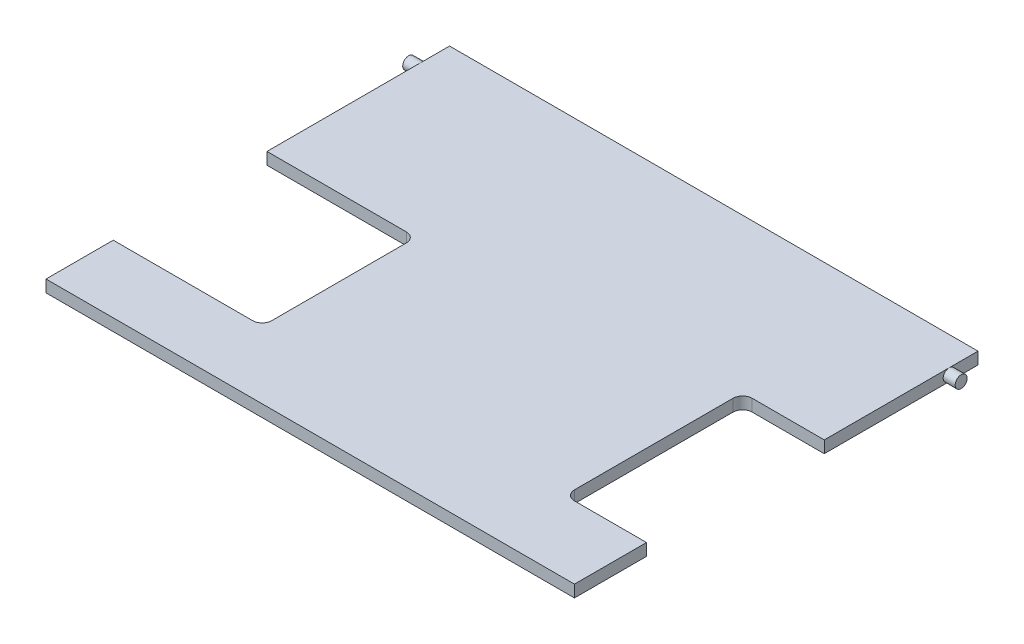
ISO-10303-21;
HEADER;
FILE_DESCRIPTION(('STEP AP214'),'2;1');
FILE_NAME('part.step','',(''),(''),'','','');
FILE_SCHEMA(('AUTOMOTIVE_DESIGN { 1 0 10303 214 1 1 1 1 }'));
ENDSEC;
DATA;
#1=APPLICATION_CONTEXT('core data for automotive mechanical design processes');
#2=APPLICATION_PROTOCOL_DEFINITION('international standard','automotive_design',2000,#1);
#3=PRODUCT_CONTEXT('',#1,'mechanical');
#4=PRODUCT('Part','Part','',(#3));
#5=PRODUCT_RELATED_PRODUCT_CATEGORY('part','',(#4));
#6=PRODUCT_DEFINITION_FORMATION('','',#4);
#7=PRODUCT_DEFINITION_CONTEXT('part definition',#1,'design');
#8=PRODUCT_DEFINITION('design','',#6,#7);
#9=PRODUCT_DEFINITION_SHAPE('','',#8);
#10=(LENGTH_UNIT() NAMED_UNIT(*) SI_UNIT(.MILLI.,.METRE.));
#11=(NAMED_UNIT(*) PLANE_ANGLE_UNIT() SI_UNIT($,.RADIAN.));
#12=(NAMED_UNIT(*) SI_UNIT($,.STERADIAN.) SOLID_ANGLE_UNIT());
#13=UNCERTAINTY_MEASURE_WITH_UNIT(LENGTH_MEASURE(1.E-05),#10,'distance_accuracy_value','');
#14=(GEOMETRIC_REPRESENTATION_CONTEXT(3) GLOBAL_UNCERTAINTY_ASSIGNED_CONTEXT((#13)) GLOBAL_UNIT_ASSIGNED_CONTEXT((#10,
#11,#12)) REPRESENTATION_CONTEXT('',''));
#15=CARTESIAN_POINT('',(0.,0.,0.));
#16=DIRECTION('',(0.,0.,1.));
#17=DIRECTION('',(1.,0.,0.));
#18=AXIS2_PLACEMENT_3D('',#15,#16,#17);
#19=CARTESIAN_POINT('',(0.,2.5,0.));
#20=DIRECTION('',(-1.,0.,0.));
#21=DIRECTION('',(0.,0.,1.));
#22=AXIS2_PLACEMENT_3D('',#19,#20,#21);
#23=PLANE('',#22);
#24=DIRECTION('',(0.,0.,-1.));
#25=VECTOR('',#24,1.);
#26=CARTESIAN_POINT('',(0.,2.5,0.));
#27=LINE('',#26,#25);
#28=CARTESIAN_POINT('',(0.,2.5,-52.));
#29=VERTEX_POINT('',#28);
#30=CARTESIAN_POINT('',(0.,2.5,-78.));
#31=VERTEX_POINT('',#30);
#32=EDGE_CURVE('E240',#29,#31,#27,.T.);
#33=ORIENTED_EDGE('',*,*,#32,.F.);
#34=DIRECTION('',(0.,1.,0.));
#35=VECTOR('',#34,1.);
#36=CARTESIAN_POINT('',(0.,-7.5,-52.));
#37=LINE('',#36,#35);
#38=CARTESIAN_POINT('',(0.,0.,-52.));
#39=VERTEX_POINT('',#38);
#40=EDGE_CURVE('E196',#39,#29,#37,.T.);
#41=ORIENTED_EDGE('',*,*,#40,.F.);
#42=DIRECTION('',(0.,0.,-1.));
#43=VECTOR('',#42,1.);
#44=CARTESIAN_POINT('',(0.,0.,0.));
#45=LINE('',#44,#43);
#46=CARTESIAN_POINT('',(0.,0.,-78.));
#47=VERTEX_POINT('',#46);
#48=EDGE_CURVE('E254',#39,#47,#45,.T.);
#49=ORIENTED_EDGE('',*,*,#48,.T.);
#50=CARTESIAN_POINT('',(0.,1.25,-78.));
#51=DIRECTION('',(1.,0.,0.));
#52=DIRECTION('',(0.,0.,-1.));
#53=AXIS2_PLACEMENT_3D('',#50,#51,#52);
#54=CIRCLE('',#53,1.25);
#55=EDGE_CURVE('E227',#31,#47,#54,.T.);
#56=ORIENTED_EDGE('',*,*,#55,.F.);
#57=EDGE_LOOP('',(#33,#41,#49,#56));
#58=FACE_BOUND('',#57,.T.);
#59=ADVANCED_FACE('F34',(#58),#23,.F.);
#60=CARTESIAN_POINT('',(-110.,2.5,0.));
#61=DIRECTION('',(1.,0.,0.));
#62=DIRECTION('',(0.,0.,-1.));
#63=AXIS2_PLACEMENT_3D('',#60,#61,#62);
#64=PLANE('',#63);
#65=DIRECTION('',(0.,0.,1.));
#66=VECTOR('',#65,1.);
#67=CARTESIAN_POINT('',(-110.,2.5,0.));
#68=LINE('',#67,#66);
#69=CARTESIAN_POINT('',(-110.,2.5,-14.));
#70=VERTEX_POINT('',#69);
#71=CARTESIAN_POINT('',(-110.,2.5,0.));
#72=VERTEX_POINT('',#71);
#73=EDGE_CURVE('E243',#70,#72,#68,.T.);
#74=ORIENTED_EDGE('',*,*,#73,.F.);
#75=DIRECTION('',(0.,1.,0.));
#76=VECTOR('',#75,1.);
#77=CARTESIAN_POINT('',(-110.,-7.5,-14.));
#78=LINE('',#77,#76);
#79=CARTESIAN_POINT('',(-110.,0.,-14.));
#80=VERTEX_POINT('',#79);
#81=EDGE_CURVE('E220',#80,#70,#78,.T.);
#82=ORIENTED_EDGE('',*,*,#81,.F.);
#83=DIRECTION('',(0.,0.,1.));
#84=VECTOR('',#83,1.);
#85=CARTESIAN_POINT('',(-110.,0.,0.));
#86=LINE('',#85,#84);
#87=CARTESIAN_POINT('',(-110.,0.,0.));
#88=VERTEX_POINT('',#87);
#89=EDGE_CURVE('E256',#80,#88,#86,.T.);
#90=ORIENTED_EDGE('',*,*,#89,.T.);
#91=DIRECTION('',(0.,-1.,0.));
#92=VECTOR('',#91,1.);
#93=CARTESIAN_POINT('',(-110.,2.5,0.));
#94=LINE('',#93,#92);
#95=EDGE_CURVE('E265',#72,#88,#94,.T.);
#96=ORIENTED_EDGE('',*,*,#95,.F.);
#97=EDGE_LOOP('',(#74,#82,#90,#96));
#98=FACE_BOUND('',#97,.T.);
#99=ADVANCED_FACE('F318',(#98),#64,.F.);
#100=CARTESIAN_POINT('',(-110.,1.25,-78.));
#101=DIRECTION('',(-1.,0.,0.));
#102=DIRECTION('',(0.,0.,1.));
#103=AXIS2_PLACEMENT_3D('',#100,#101,#102);
#104=CIRCLE('',#103,1.25);
#105=CARTESIAN_POINT('',(-110.,2.5,-78.));
#106=VERTEX_POINT('',#105);
#107=CARTESIAN_POINT('',(-110.,0.,-78.));
#108=VERTEX_POINT('',#107);
#109=EDGE_CURVE('E215',#106,#108,#104,.T.);
#110=ORIENTED_EDGE('',*,*,#109,.F.);
#111=CARTESIAN_POINT('',(-110.,2.5,-84.));
#112=VERTEX_POINT('',#111);
#113=EDGE_CURVE('E244',#112,#106,#68,.T.);
#114=ORIENTED_EDGE('',*,*,#113,.F.);
#115=DIRECTION('',(0.,-1.,0.));
#116=VECTOR('',#115,1.);
#117=CARTESIAN_POINT('',(-110.,2.5,-84.));
#118=LINE('',#117,#116);
#119=CARTESIAN_POINT('',(-110.,0.,-84.));
#120=VERTEX_POINT('',#119);
#121=EDGE_CURVE('E268',#112,#120,#118,.T.);
#122=ORIENTED_EDGE('',*,*,#121,.T.);
#123=EDGE_CURVE('E257',#120,#108,#86,.T.);
#124=ORIENTED_EDGE('',*,*,#123,.T.);
#125=EDGE_LOOP('',(#110,#114,#122,#124));
#126=FACE_BOUND('',#125,.T.);
#127=ADVANCED_FACE('F324',(#126),#64,.F.);
#128=CARTESIAN_POINT('',(0.,0.,0.));
#129=VERTEX_POINT('',#128);
#130=CARTESIAN_POINT('',(0.,0.,-15.));
#131=VERTEX_POINT('',#130);
#132=EDGE_CURVE('E250',#129,#131,#45,.T.);
#133=ORIENTED_EDGE('',*,*,#132,.T.);
#134=DIRECTION('',(0.,1.,0.));
#135=VECTOR('',#134,1.);
#136=CARTESIAN_POINT('',(0.,-7.5,-15.));
#137=LINE('',#136,#135);
#138=CARTESIAN_POINT('',(0.,2.5,-15.));
#139=VERTEX_POINT('',#138);
#140=EDGE_CURVE('E49',#131,#139,#137,.T.);
#141=ORIENTED_EDGE('',*,*,#140,.T.);
#142=CARTESIAN_POINT('',(0.,2.5,0.));
#143=VERTEX_POINT('',#142);
#144=EDGE_CURVE('E180',#143,#139,#27,.T.);
#145=ORIENTED_EDGE('',*,*,#144,.F.);
#146=DIRECTION('',(0.,-1.,0.));
#147=VECTOR('',#146,1.);
#148=CARTESIAN_POINT('',(0.,2.5,0.));
#149=LINE('',#148,#147);
#150=EDGE_CURVE('E249',#143,#129,#149,.T.);
#151=ORIENTED_EDGE('',*,*,#150,.T.);
#152=EDGE_LOOP('',(#133,#141,#145,#151));
#153=FACE_BOUND('',#152,.T.);
#154=ADVANCED_FACE('F320',(#153),#23,.F.);
#155=EDGE_CURVE('E237',#47,#31,#54,.T.);
#156=ORIENTED_EDGE('',*,*,#155,.F.);
#157=CARTESIAN_POINT('',(0.,0.,-84.));
#158=VERTEX_POINT('',#157);
#159=EDGE_CURVE('E234',#47,#158,#45,.T.);
#160=ORIENTED_EDGE('',*,*,#159,.T.);
#161=DIRECTION('',(0.,-1.,0.));
#162=VECTOR('',#161,1.);
#163=CARTESIAN_POINT('',(0.,2.5,-84.));
#164=LINE('',#163,#162);
#165=CARTESIAN_POINT('',(0.,2.5,-84.));
#166=VERTEX_POINT('',#165);
#167=EDGE_CURVE('E271',#166,#158,#164,.T.);
#168=ORIENTED_EDGE('',*,*,#167,.F.);
#169=EDGE_CURVE('E241',#31,#166,#27,.T.);
#170=ORIENTED_EDGE('',*,*,#169,.F.);
#171=EDGE_LOOP('',(#156,#160,#168,#170));
#172=FACE_BOUND('',#171,.T.);
#173=ADVANCED_FACE('F36',(#172),#23,.F.);
#174=CARTESIAN_POINT('',(0.,2.5,-84.));
#175=DIRECTION('',(0.,0.,1.));
#176=DIRECTION('',(1.,0.,0.));
#177=AXIS2_PLACEMENT_3D('',#174,#175,#176);
#178=PLANE('',#177);
#179=DIRECTION('',(-1.,0.,0.));
#180=VECTOR('',#179,1.);
#181=CARTESIAN_POINT('',(0.,0.,-84.));
#182=LINE('',#181,#180);
#183=EDGE_CURVE('E253',#158,#120,#182,.T.);
#184=ORIENTED_EDGE('',*,*,#183,.T.);
#185=ORIENTED_EDGE('',*,*,#121,.F.);
#186=DIRECTION('',(-1.,0.,0.));
#187=VECTOR('',#186,1.);
#188=CARTESIAN_POINT('',(0.,2.5,-84.));
#189=LINE('',#188,#187);
#190=EDGE_CURVE('E239',#166,#112,#189,.T.);
#191=ORIENTED_EDGE('',*,*,#190,.F.);
#192=ORIENTED_EDGE('',*,*,#167,.T.);
#193=EDGE_LOOP('',(#184,#185,#191,#192));
#194=FACE_BOUND('',#193,.T.);
#195=ADVANCED_FACE('F331',(#194),#178,.F.);
#196=CARTESIAN_POINT('',(-110.,0.,-46.));
#197=VERTEX_POINT('',#196);
#198=EDGE_CURVE('E261',#108,#197,#86,.T.);
#199=ORIENTED_EDGE('',*,*,#198,.T.);
#200=DIRECTION('',(0.,1.,0.));
#201=VECTOR('',#200,1.);
#202=CARTESIAN_POINT('',(-110.,-7.5,-46.));
#203=LINE('',#202,#201);
#204=CARTESIAN_POINT('',(-110.,2.5,-46.));
#205=VERTEX_POINT('',#204);
#206=EDGE_CURVE('E57',#197,#205,#203,.T.);
#207=ORIENTED_EDGE('',*,*,#206,.T.);
#208=EDGE_CURVE('E247',#106,#205,#68,.T.);
#209=ORIENTED_EDGE('',*,*,#208,.F.);
#210=EDGE_CURVE('E230',#108,#106,#104,.T.);
#211=ORIENTED_EDGE('',*,*,#210,.F.);
#212=EDGE_LOOP('',(#199,#207,#209,#211));
#213=FACE_BOUND('',#212,.T.);
#214=ADVANCED_FACE('F327',(#213),#64,.F.);
#215=CARTESIAN_POINT('',(0.,2.5,0.));
#216=DIRECTION('',(0.,0.,-1.));
#217=DIRECTION('',(-1.,0.,0.));
#218=AXIS2_PLACEMENT_3D('',#215,#216,#217);
#219=PLANE('',#218);
#220=DIRECTION('',(1.,0.,0.));
#221=VECTOR('',#220,1.);
#222=CARTESIAN_POINT('',(0.,0.,0.));
#223=LINE('',#222,#221);
#224=EDGE_CURVE('E260',#88,#129,#223,.T.);
#225=ORIENTED_EDGE('',*,*,#224,.T.);
#226=ORIENTED_EDGE('',*,*,#150,.F.);
#227=DIRECTION('',(1.,0.,0.));
#228=VECTOR('',#227,1.);
#229=CARTESIAN_POINT('',(0.,2.5,0.));
#230=LINE('',#229,#228);
#231=EDGE_CURVE('E246',#72,#143,#230,.T.);
#232=ORIENTED_EDGE('',*,*,#231,.F.);
#233=ORIENTED_EDGE('',*,*,#95,.T.);
#234=EDGE_LOOP('',(#225,#226,#232,#233));
#235=FACE_BOUND('',#234,.T.);
#236=ADVANCED_FACE('F369',(#235),#219,.F.);
#237=CARTESIAN_POINT('',(0.,2.5,0.));
#238=DIRECTION('',(0.,1.,0.));
#239=DIRECTION('',(0.,0.,1.));
#240=AXIS2_PLACEMENT_3D('',#237,#238,#239);
#241=PLANE('',#240);
#242=DIRECTION('',(-1.,0.,0.));
#243=VECTOR('',#242,1.);
#244=CARTESIAN_POINT('',(-15.,2.5,-52.));
#245=LINE('',#244,#243);
#246=CARTESIAN_POINT('',(-15.,2.5,-52.));
#247=VERTEX_POINT('',#246);
#248=EDGE_CURVE('E181',#29,#247,#245,.T.);
#249=ORIENTED_EDGE('',*,*,#248,.F.);
#250=ORIENTED_EDGE('',*,*,#32,.T.);
#251=ORIENTED_EDGE('',*,*,#169,.T.);
#252=ORIENTED_EDGE('',*,*,#190,.T.);
#253=ORIENTED_EDGE('',*,*,#113,.T.);
#254=ORIENTED_EDGE('',*,*,#208,.T.);
#255=DIRECTION('',(-1.,0.,0.));
#256=VECTOR('',#255,1.);
#257=CARTESIAN_POINT('',(-81.,2.5,-46.));
#258=LINE('',#257,#256);
#259=CARTESIAN_POINT('',(-81.,2.5,-46.));
#260=VERTEX_POINT('',#259);
#261=EDGE_CURVE('E201',#260,#205,#258,.T.);
#262=ORIENTED_EDGE('',*,*,#261,.F.);
#263=CARTESIAN_POINT('',(-81.,2.5,-44.));
#264=DIRECTION('',(0.,1.,0.));
#265=DIRECTION('',(0.,0.,1.));
#266=AXIS2_PLACEMENT_3D('',#263,#264,#265);
#267=CIRCLE('',#266,2.);
#268=CARTESIAN_POINT('',(-79.,2.5,-44.));
#269=VERTEX_POINT('',#268);
#270=EDGE_CURVE('E191',#269,#260,#267,.T.);
#271=ORIENTED_EDGE('',*,*,#270,.F.);
#272=DIRECTION('',(0.,0.,-1.));
#273=VECTOR('',#272,1.);
#274=CARTESIAN_POINT('',(-79.,2.5,-16.));
#275=LINE('',#274,#273);
#276=CARTESIAN_POINT('',(-79.,2.5,-16.));
#277=VERTEX_POINT('',#276);
#278=EDGE_CURVE('E209',#277,#269,#275,.T.);
#279=ORIENTED_EDGE('',*,*,#278,.F.);
#280=CARTESIAN_POINT('',(-81.,2.5,-16.));
#281=DIRECTION('',(0.,1.,0.));
#282=DIRECTION('',(0.,0.,1.));
#283=AXIS2_PLACEMENT_3D('',#280,#281,#282);
#284=CIRCLE('',#283,2.);
#285=CARTESIAN_POINT('',(-81.,2.5,-14.));
#286=VERTEX_POINT('',#285);
#287=EDGE_CURVE('E206',#286,#277,#284,.T.);
#288=ORIENTED_EDGE('',*,*,#287,.F.);
#289=DIRECTION('',(1.,0.,0.));
#290=VECTOR('',#289,1.);
#291=CARTESIAN_POINT('',(-81.,2.5,-14.));
#292=LINE('',#291,#290);
#293=EDGE_CURVE('E203',#70,#286,#292,.T.);
#294=ORIENTED_EDGE('',*,*,#293,.F.);
#295=ORIENTED_EDGE('',*,*,#73,.T.);
#296=ORIENTED_EDGE('',*,*,#231,.T.);
#297=ORIENTED_EDGE('',*,*,#144,.T.);
#298=DIRECTION('',(1.,0.,0.));
#299=VECTOR('',#298,1.);
#300=CARTESIAN_POINT('',(-15.,2.5,-15.));
#301=LINE('',#300,#299);
#302=CARTESIAN_POINT('',(-15.,2.5,-15.));
#303=VERTEX_POINT('',#302);
#304=EDGE_CURVE('E161',#303,#139,#301,.T.);
#305=ORIENTED_EDGE('',*,*,#304,.F.);
#306=CARTESIAN_POINT('',(-15.,2.5,-17.));
#307=DIRECTION('',(0.,1.,0.));
#308=DIRECTION('',(0.,0.,-1.));
#309=AXIS2_PLACEMENT_3D('',#306,#307,#308);
#310=CIRCLE('',#309,2.);
#311=CARTESIAN_POINT('',(-17.,2.5,-17.));
#312=VERTEX_POINT('',#311);
#313=EDGE_CURVE('E168',#312,#303,#310,.T.);
#314=ORIENTED_EDGE('',*,*,#313,.F.);
#315=DIRECTION('',(0.,0.,1.));
#316=VECTOR('',#315,1.);
#317=CARTESIAN_POINT('',(-17.,2.5,-17.));
#318=LINE('',#317,#316);
#319=CARTESIAN_POINT('',(-17.,2.5,-50.));
#320=VERTEX_POINT('',#319);
#321=EDGE_CURVE('E165',#320,#312,#318,.T.);
#322=ORIENTED_EDGE('',*,*,#321,.F.);
#323=CARTESIAN_POINT('',(-15.,2.5,-50.));
#324=DIRECTION('',(0.,1.,0.));
#325=DIRECTION('',(0.,0.,-1.));
#326=AXIS2_PLACEMENT_3D('',#323,#324,#325);
#327=CIRCLE('',#326,2.);
#328=EDGE_CURVE('E184',#247,#320,#327,.T.);
#329=ORIENTED_EDGE('',*,*,#328,.F.);
#330=EDGE_LOOP('',(#249,#250,#251,#252,#253,#254,#262,#271,#279,#288,#294,#295,#296,#297,#305,
#314,#322,#329));
#331=FACE_BOUND('',#330,.T.);
#332=ADVANCED_FACE('F178',(#331),#241,.T.);
#333=CARTESIAN_POINT('',(0.,0.,0.));
#334=DIRECTION('',(0.,1.,0.));
#335=DIRECTION('',(0.,0.,1.));
#336=AXIS2_PLACEMENT_3D('',#333,#334,#335);
#337=PLANE('',#336);
#338=ORIENTED_EDGE('',*,*,#48,.F.);
#339=DIRECTION('',(-1.,0.,0.));
#340=VECTOR('',#339,1.);
#341=CARTESIAN_POINT('',(0.,0.,-52.));
#342=LINE('',#341,#340);
#343=CARTESIAN_POINT('',(-15.,0.,-52.));
#344=VERTEX_POINT('',#343);
#345=EDGE_CURVE('E11',#39,#344,#342,.T.);
#346=ORIENTED_EDGE('',*,*,#345,.T.);
#347=CARTESIAN_POINT('',(-15.,0.,-50.));
#348=DIRECTION('',(0.,1.,0.));
#349=DIRECTION('',(0.,0.,1.));
#350=AXIS2_PLACEMENT_3D('',#347,#348,#349);
#351=CIRCLE('',#350,2.);
#352=CARTESIAN_POINT('',(-17.,0.,-50.));
#353=VERTEX_POINT('',#352);
#354=EDGE_CURVE('E42',#344,#353,#351,.T.);
#355=ORIENTED_EDGE('',*,*,#354,.T.);
#356=DIRECTION('',(0.,0.,1.));
#357=VECTOR('',#356,1.);
#358=CARTESIAN_POINT('',(-17.,0.,0.));
#359=LINE('',#358,#357);
#360=CARTESIAN_POINT('',(-17.,0.,-17.));
#361=VERTEX_POINT('',#360);
#362=EDGE_CURVE('E291',#353,#361,#359,.T.);
#363=ORIENTED_EDGE('',*,*,#362,.T.);
#364=CARTESIAN_POINT('',(-15.,0.,-17.));
#365=DIRECTION('',(0.,1.,0.));
#366=DIRECTION('',(0.,0.,1.));
#367=AXIS2_PLACEMENT_3D('',#364,#365,#366);
#368=CIRCLE('',#367,2.);
#369=CARTESIAN_POINT('',(-15.,0.,-15.));
#370=VERTEX_POINT('',#369);
#371=EDGE_CURVE('E289',#361,#370,#368,.T.);
#372=ORIENTED_EDGE('',*,*,#371,.T.);
#373=DIRECTION('',(1.,0.,0.));
#374=VECTOR('',#373,1.);
#375=CARTESIAN_POINT('',(0.,0.,-15.));
#376=LINE('',#375,#374);
#377=EDGE_CURVE('E162',#370,#131,#376,.T.);
#378=ORIENTED_EDGE('',*,*,#377,.T.);
#379=ORIENTED_EDGE('',*,*,#132,.F.);
#380=ORIENTED_EDGE('',*,*,#224,.F.);
#381=ORIENTED_EDGE('',*,*,#89,.F.);
#382=DIRECTION('',(1.,0.,0.));
#383=VECTOR('',#382,1.);
#384=CARTESIAN_POINT('',(0.,0.,-14.));
#385=LINE('',#384,#383);
#386=CARTESIAN_POINT('',(-81.,0.,-14.));
#387=VERTEX_POINT('',#386);
#388=EDGE_CURVE('E285',#80,#387,#385,.T.);
#389=ORIENTED_EDGE('',*,*,#388,.T.);
#390=CARTESIAN_POINT('',(-81.,0.,-16.));
#391=DIRECTION('',(0.,1.,0.));
#392=DIRECTION('',(0.,0.,1.));
#393=AXIS2_PLACEMENT_3D('',#390,#391,#392);
#394=CIRCLE('',#393,2.);
#395=CARTESIAN_POINT('',(-79.,0.,-16.));
#396=VERTEX_POINT('',#395);
#397=EDGE_CURVE('E282',#387,#396,#394,.T.);
#398=ORIENTED_EDGE('',*,*,#397,.T.);
#399=DIRECTION('',(0.,0.,-1.));
#400=VECTOR('',#399,1.);
#401=CARTESIAN_POINT('',(-79.,0.,0.));
#402=LINE('',#401,#400);
#403=CARTESIAN_POINT('',(-79.,0.,-44.));
#404=VERTEX_POINT('',#403);
#405=EDGE_CURVE('E279',#396,#404,#402,.T.);
#406=ORIENTED_EDGE('',*,*,#405,.T.);
#407=CARTESIAN_POINT('',(-81.,0.,-44.));
#408=DIRECTION('',(0.,1.,0.));
#409=DIRECTION('',(0.,0.,1.));
#410=AXIS2_PLACEMENT_3D('',#407,#408,#409);
#411=CIRCLE('',#410,2.);
#412=CARTESIAN_POINT('',(-81.,0.,-46.));
#413=VERTEX_POINT('',#412);
#414=EDGE_CURVE('E276',#404,#413,#411,.T.);
#415=ORIENTED_EDGE('',*,*,#414,.T.);
#416=DIRECTION('',(-1.,0.,0.));
#417=VECTOR('',#416,1.);
#418=CARTESIAN_POINT('',(0.,0.,-46.));
#419=LINE('',#418,#417);
#420=EDGE_CURVE('E274',#413,#197,#419,.T.);
#421=ORIENTED_EDGE('',*,*,#420,.T.);
#422=ORIENTED_EDGE('',*,*,#198,.F.);
#423=ORIENTED_EDGE('',*,*,#123,.F.);
#424=ORIENTED_EDGE('',*,*,#183,.F.);
#425=ORIENTED_EDGE('',*,*,#159,.F.);
#426=EDGE_LOOP('',(#338,#346,#355,#363,#372,#378,#379,#380,#381,#389,#398,#406,#415,#421,#422,
#423,#424,#425));
#427=FACE_BOUND('',#426,.T.);
#428=ADVANCED_FACE('F296',(#427),#337,.F.);
#429=CARTESIAN_POINT('',(2.5,1.25,-78.));
#430=DIRECTION('',(-1.,0.,0.));
#431=DIRECTION('',(0.,0.,1.));
#432=AXIS2_PLACEMENT_3D('',#429,#430,#431);
#433=CYLINDRICAL_SURFACE('',#432,1.25);
#434=CARTESIAN_POINT('',(2.5,1.25,-78.));
#435=DIRECTION('',(1.,0.,0.));
#436=DIRECTION('',(0.,0.,-1.));
#437=AXIS2_PLACEMENT_3D('',#434,#435,#436);
#438=CIRCLE('',#437,1.25);
#439=CARTESIAN_POINT('',(2.5,1.25,-79.25));
#440=VERTEX_POINT('',#439);
#441=EDGE_CURVE('E231',#440,#440,#438,.T.);
#442=ORIENTED_EDGE('',*,*,#441,.F.);
#443=EDGE_LOOP('',(#442));
#444=FACE_BOUND('',#443,.T.);
#445=ORIENTED_EDGE('',*,*,#55,.T.);
#446=ORIENTED_EDGE('',*,*,#155,.T.);
#447=EDGE_LOOP('',(#445,#446));
#448=FACE_BOUND('',#447,.T.);
#449=ADVANCED_FACE('F346',(#444,#448),#433,.T.);
#450=CARTESIAN_POINT('',(2.5,1.25,-78.));
#451=DIRECTION('',(1.,0.,0.));
#452=DIRECTION('',(0.,0.,-1.));
#453=AXIS2_PLACEMENT_3D('',#450,#451,#452);
#454=PLANE('',#453);
#455=ORIENTED_EDGE('',*,*,#441,.T.);
#456=EDGE_LOOP('',(#455));
#457=FACE_BOUND('',#456,.T.);
#458=ADVANCED_FACE('F375',(#457),#454,.T.);
#459=CARTESIAN_POINT('',(-112.5,1.25,-78.));
#460=DIRECTION('',(1.,0.,0.));
#461=DIRECTION('',(0.,0.,-1.));
#462=AXIS2_PLACEMENT_3D('',#459,#460,#461);
#463=CYLINDRICAL_SURFACE('',#462,1.25);
#464=CARTESIAN_POINT('',(-112.5,1.25,-78.));
#465=DIRECTION('',(-1.,0.,0.));
#466=DIRECTION('',(0.,0.,1.));
#467=AXIS2_PLACEMENT_3D('',#464,#465,#466);
#468=CIRCLE('',#467,1.25);
#469=CARTESIAN_POINT('',(-112.5,1.25,-76.75));
#470=VERTEX_POINT('',#469);
#471=EDGE_CURVE('E224',#470,#470,#468,.T.);
#472=ORIENTED_EDGE('',*,*,#471,.F.);
#473=EDGE_LOOP('',(#472));
#474=FACE_BOUND('',#473,.T.);
#475=ORIENTED_EDGE('',*,*,#109,.T.);
#476=ORIENTED_EDGE('',*,*,#210,.T.);
#477=EDGE_LOOP('',(#475,#476));
#478=FACE_BOUND('',#477,.T.);
#479=ADVANCED_FACE('F372',(#474,#478),#463,.T.);
#480=CARTESIAN_POINT('',(-112.5,1.25,-78.));
#481=DIRECTION('',(-1.,0.,0.));
#482=DIRECTION('',(0.,0.,1.));
#483=AXIS2_PLACEMENT_3D('',#480,#481,#482);
#484=PLANE('',#483);
#485=ORIENTED_EDGE('',*,*,#471,.T.);
#486=EDGE_LOOP('',(#485));
#487=FACE_BOUND('',#486,.T.);
#488=ADVANCED_FACE('F374',(#487),#484,.T.);
#489=CARTESIAN_POINT('',(-81.,-7.5,-44.));
#490=DIRECTION('',(0.,1.,0.));
#491=DIRECTION('',(0.,0.,1.));
#492=AXIS2_PLACEMENT_3D('',#489,#490,#491);
#493=CYLINDRICAL_SURFACE('',#492,2.);
#494=DIRECTION('',(0.,1.,0.));
#495=VECTOR('',#494,1.);
#496=CARTESIAN_POINT('',(-79.,-7.5,-44.));
#497=LINE('',#496,#495);
#498=EDGE_CURVE('E213',#404,#269,#497,.T.);
#499=ORIENTED_EDGE('',*,*,#498,.T.);
#500=ORIENTED_EDGE('',*,*,#270,.T.);
#501=DIRECTION('',(0.,1.,0.));
#502=VECTOR('',#501,1.);
#503=CARTESIAN_POINT('',(-81.,-7.5,-46.));
#504=LINE('',#503,#502);
#505=EDGE_CURVE('E212',#413,#260,#504,.T.);
#506=ORIENTED_EDGE('',*,*,#505,.F.);
#507=ORIENTED_EDGE('',*,*,#414,.F.);
#508=EDGE_LOOP('',(#499,#500,#506,#507));
#509=FACE_BOUND('',#508,.T.);
#510=ADVANCED_FACE('F382',(#509),#493,.F.);
#511=CARTESIAN_POINT('',(-79.,-7.5,-16.));
#512=DIRECTION('',(1.,0.,0.));
#513=DIRECTION('',(0.,0.,-1.));
#514=AXIS2_PLACEMENT_3D('',#511,#512,#513);
#515=PLANE('',#514);
#516=DIRECTION('',(0.,1.,0.));
#517=VECTOR('',#516,1.);
#518=CARTESIAN_POINT('',(-79.,-7.5,-16.));
#519=LINE('',#518,#517);
#520=EDGE_CURVE('E216',#396,#277,#519,.T.);
#521=ORIENTED_EDGE('',*,*,#520,.T.);
#522=ORIENTED_EDGE('',*,*,#278,.T.);
#523=ORIENTED_EDGE('',*,*,#498,.F.);
#524=ORIENTED_EDGE('',*,*,#405,.F.);
#525=EDGE_LOOP('',(#521,#522,#523,#524));
#526=FACE_BOUND('',#525,.T.);
#527=ADVANCED_FACE('F441',(#526),#515,.F.);
#528=CARTESIAN_POINT('',(-81.,-7.5,-16.));
#529=DIRECTION('',(0.,1.,0.));
#530=DIRECTION('',(0.,0.,1.));
#531=AXIS2_PLACEMENT_3D('',#528,#529,#530);
#532=CYLINDRICAL_SURFACE('',#531,2.);
#533=DIRECTION('',(0.,1.,0.));
#534=VECTOR('',#533,1.);
#535=CARTESIAN_POINT('',(-81.,-7.5,-14.));
#536=LINE('',#535,#534);
#537=EDGE_CURVE('E218',#387,#286,#536,.T.);
#538=ORIENTED_EDGE('',*,*,#537,.T.);
#539=ORIENTED_EDGE('',*,*,#287,.T.);
#540=ORIENTED_EDGE('',*,*,#520,.F.);
#541=ORIENTED_EDGE('',*,*,#397,.F.);
#542=EDGE_LOOP('',(#538,#539,#540,#541));
#543=FACE_BOUND('',#542,.T.);
#544=ADVANCED_FACE('F451',(#543),#532,.F.);
#545=CARTESIAN_POINT('',(-81.,-7.5,-14.));
#546=DIRECTION('',(0.,0.,1.));
#547=DIRECTION('',(1.,0.,0.));
#548=AXIS2_PLACEMENT_3D('',#545,#546,#547);
#549=PLANE('',#548);
#550=ORIENTED_EDGE('',*,*,#81,.T.);
#551=ORIENTED_EDGE('',*,*,#293,.T.);
#552=ORIENTED_EDGE('',*,*,#537,.F.);
#553=ORIENTED_EDGE('',*,*,#388,.F.);
#554=EDGE_LOOP('',(#550,#551,#552,#553));
#555=FACE_BOUND('',#554,.T.);
#556=ADVANCED_FACE('F461',(#555),#549,.F.);
#557=CARTESIAN_POINT('',(-81.,-7.5,-46.));
#558=DIRECTION('',(0.,0.,-1.));
#559=DIRECTION('',(-1.,0.,0.));
#560=AXIS2_PLACEMENT_3D('',#557,#558,#559);
#561=PLANE('',#560);
#562=ORIENTED_EDGE('',*,*,#505,.T.);
#563=ORIENTED_EDGE('',*,*,#261,.T.);
#564=ORIENTED_EDGE('',*,*,#206,.F.);
#565=ORIENTED_EDGE('',*,*,#420,.F.);
#566=EDGE_LOOP('',(#562,#563,#564,#565));
#567=FACE_BOUND('',#566,.T.);
#568=ADVANCED_FACE('F315',(#567),#561,.F.);
#569=CARTESIAN_POINT('',(-15.,-7.5,-17.));
#570=DIRECTION('',(0.,1.,0.));
#571=DIRECTION('',(0.,0.,1.));
#572=AXIS2_PLACEMENT_3D('',#569,#570,#571);
#573=CYLINDRICAL_SURFACE('',#572,2.);
#574=DIRECTION('',(0.,1.,0.));
#575=VECTOR('',#574,1.);
#576=CARTESIAN_POINT('',(-17.,-7.5,-17.));
#577=LINE('',#576,#575);
#578=EDGE_CURVE('E171',#361,#312,#577,.T.);
#579=ORIENTED_EDGE('',*,*,#578,.T.);
#580=ORIENTED_EDGE('',*,*,#313,.T.);
#581=DIRECTION('',(0.,1.,0.));
#582=VECTOR('',#581,1.);
#583=CARTESIAN_POINT('',(-15.,-7.5,-15.));
#584=LINE('',#583,#582);
#585=EDGE_CURVE('E157',#370,#303,#584,.T.);
#586=ORIENTED_EDGE('',*,*,#585,.F.);
#587=ORIENTED_EDGE('',*,*,#371,.F.);
#588=EDGE_LOOP('',(#579,#580,#586,#587));
#589=FACE_BOUND('',#588,.T.);
#590=ADVANCED_FACE('F169',(#589),#573,.F.);
#591=CARTESIAN_POINT('',(-17.,-7.5,-17.));
#592=DIRECTION('',(-1.,0.,0.));
#593=DIRECTION('',(0.,0.,1.));
#594=AXIS2_PLACEMENT_3D('',#591,#592,#593);
#595=PLANE('',#594);
#596=DIRECTION('',(0.,1.,0.));
#597=VECTOR('',#596,1.);
#598=CARTESIAN_POINT('',(-17.,-7.5,-50.));
#599=LINE('',#598,#597);
#600=EDGE_CURVE('E192',#353,#320,#599,.T.);
#601=ORIENTED_EDGE('',*,*,#600,.T.);
#602=ORIENTED_EDGE('',*,*,#321,.T.);
#603=ORIENTED_EDGE('',*,*,#578,.F.);
#604=ORIENTED_EDGE('',*,*,#362,.F.);
#605=EDGE_LOOP('',(#601,#602,#603,#604));
#606=FACE_BOUND('',#605,.T.);
#607=ADVANCED_FACE('F307',(#606),#595,.F.);
#608=CARTESIAN_POINT('',(-15.,-7.5,-50.));
#609=DIRECTION('',(0.,1.,0.));
#610=DIRECTION('',(0.,0.,1.));
#611=AXIS2_PLACEMENT_3D('',#608,#609,#610);
#612=CYLINDRICAL_SURFACE('',#611,2.);
#613=DIRECTION('',(0.,1.,0.));
#614=VECTOR('',#613,1.);
#615=CARTESIAN_POINT('',(-15.,-7.5,-52.));
#616=LINE('',#615,#614);
#617=EDGE_CURVE('E194',#344,#247,#616,.T.);
#618=ORIENTED_EDGE('',*,*,#617,.T.);
#619=ORIENTED_EDGE('',*,*,#328,.T.);
#620=ORIENTED_EDGE('',*,*,#600,.F.);
#621=ORIENTED_EDGE('',*,*,#354,.F.);
#622=EDGE_LOOP('',(#618,#619,#620,#621));
#623=FACE_BOUND('',#622,.T.);
#624=ADVANCED_FACE('F300',(#623),#612,.F.);
#625=CARTESIAN_POINT('',(-15.,-7.5,-52.));
#626=DIRECTION('',(0.,0.,-1.));
#627=DIRECTION('',(-1.,0.,0.));
#628=AXIS2_PLACEMENT_3D('',#625,#626,#627);
#629=PLANE('',#628);
#630=ORIENTED_EDGE('',*,*,#40,.T.);
#631=ORIENTED_EDGE('',*,*,#248,.T.);
#632=ORIENTED_EDGE('',*,*,#617,.F.);
#633=ORIENTED_EDGE('',*,*,#345,.F.);
#634=EDGE_LOOP('',(#630,#631,#632,#633));
#635=FACE_BOUND('',#634,.T.);
#636=ADVANCED_FACE('F302',(#635),#629,.F.);
#637=CARTESIAN_POINT('',(-15.,-7.5,-15.));
#638=DIRECTION('',(0.,0.,1.));
#639=DIRECTION('',(1.,0.,0.));
#640=AXIS2_PLACEMENT_3D('',#637,#638,#639);
#641=PLANE('',#640);
#642=ORIENTED_EDGE('',*,*,#585,.T.);
#643=ORIENTED_EDGE('',*,*,#304,.T.);
#644=ORIENTED_EDGE('',*,*,#140,.F.);
#645=ORIENTED_EDGE('',*,*,#377,.F.);
#646=EDGE_LOOP('',(#642,#643,#644,#645));
#647=FACE_BOUND('',#646,.T.);
#648=ADVANCED_FACE('F159',(#647),#641,.F.);
#649=CLOSED_SHELL('',(#59,#99,#127,#154,#173,#195,#214,#236,#332,#428,#449,#458,#479,#488,#510,
#527,#544,#556,#568,#590,#607,#624,#636,#648));
#650=MANIFOLD_SOLID_BREP('B2',#649);
#651=ADVANCED_BREP_SHAPE_REPRESENTATION('',(#18,#650),#14);
#652=SHAPE_DEFINITION_REPRESENTATION(#9,#651);
ENDSEC;
END-ISO-10303-21;
